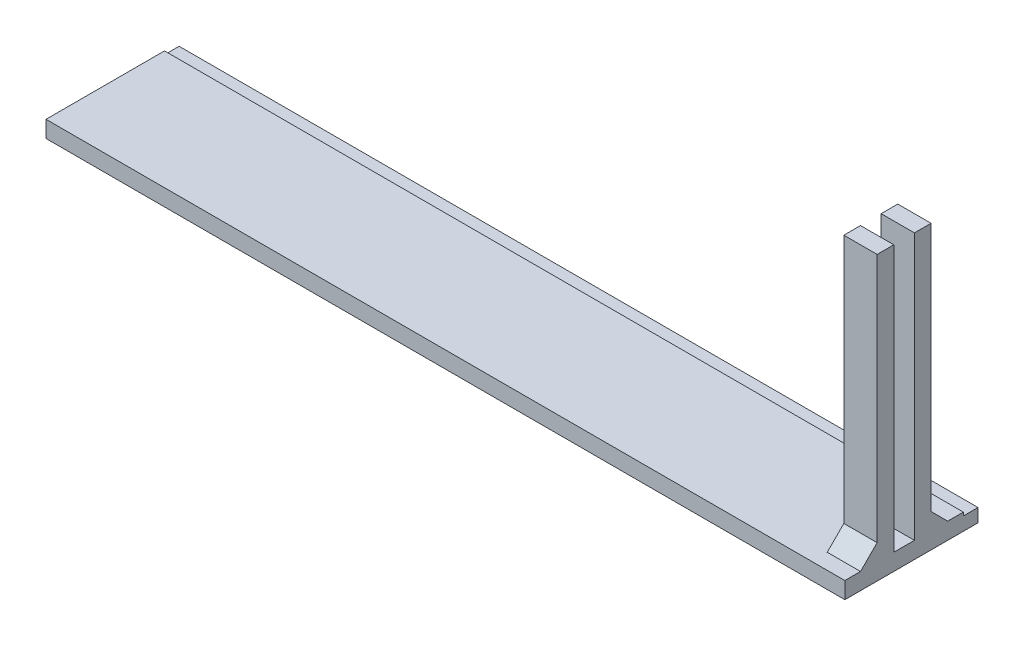
ISO-10303-21;
HEADER;
FILE_DESCRIPTION(('STEP AP214'),'2;1');
FILE_NAME('part.step','',(''),(''),'','','');
FILE_SCHEMA(('AUTOMOTIVE_DESIGN { 1 0 10303 214 1 1 1 1 }'));
ENDSEC;
DATA;
#1=APPLICATION_CONTEXT('core data for automotive mechanical design processes');
#2=APPLICATION_PROTOCOL_DEFINITION('international standard','automotive_design',2000,#1);
#3=PRODUCT_CONTEXT('',#1,'mechanical');
#4=PRODUCT('Part','Part','',(#3));
#5=PRODUCT_RELATED_PRODUCT_CATEGORY('part','',(#4));
#6=PRODUCT_DEFINITION_FORMATION('','',#4);
#7=PRODUCT_DEFINITION_CONTEXT('part definition',#1,'design');
#8=PRODUCT_DEFINITION('design','',#6,#7);
#9=PRODUCT_DEFINITION_SHAPE('','',#8);
#10=(LENGTH_UNIT() NAMED_UNIT(*) SI_UNIT(.MILLI.,.METRE.));
#11=(NAMED_UNIT(*) PLANE_ANGLE_UNIT() SI_UNIT($,.RADIAN.));
#12=(NAMED_UNIT(*) SI_UNIT($,.STERADIAN.) SOLID_ANGLE_UNIT());
#13=UNCERTAINTY_MEASURE_WITH_UNIT(LENGTH_MEASURE(1.E-05),#10,'distance_accuracy_value','');
#14=(GEOMETRIC_REPRESENTATION_CONTEXT(3) GLOBAL_UNCERTAINTY_ASSIGNED_CONTEXT((#13)) GLOBAL_UNIT_ASSIGNED_CONTEXT((#10,
#11,#12)) REPRESENTATION_CONTEXT('',''));
#15=CARTESIAN_POINT('',(0.,0.,0.));
#16=DIRECTION('',(0.,0.,1.));
#17=DIRECTION('',(1.,0.,0.));
#18=AXIS2_PLACEMENT_3D('',#15,#16,#17);
#19=CARTESIAN_POINT('',(0.,3.175,0.));
#20=DIRECTION('',(0.,-1.,0.));
#21=DIRECTION('',(0.,0.,-1.));
#22=AXIS2_PLACEMENT_3D('',#19,#20,#21);
#23=PLANE('',#22);
#24=DIRECTION('',(0.,0.,-1.));
#25=VECTOR('',#24,1.);
#26=CARTESIAN_POINT('',(146.05,3.175,-13.2715));
#27=LINE('',#26,#25);
#28=CARTESIAN_POINT('',(146.05,3.175,-13.2715));
#29=VERTEX_POINT('',#28);
#30=CARTESIAN_POINT('',(146.05,3.175,-19.6215));
#31=VERTEX_POINT('',#30);
#32=EDGE_CURVE('E169',#29,#31,#27,.T.);
#33=ORIENTED_EDGE('',*,*,#32,.T.);
#34=DIRECTION('',(1.,0.,0.));
#35=VECTOR('',#34,1.);
#36=CARTESIAN_POINT('',(0.,3.175,-19.6215));
#37=LINE('',#36,#35);
#38=CARTESIAN_POINT('',(152.4,3.175,-19.6215));
#39=VERTEX_POINT('',#38);
#40=EDGE_CURVE('E310',#31,#39,#37,.T.);
#41=ORIENTED_EDGE('',*,*,#40,.T.);
#42=DIRECTION('',(0.,0.,-1.));
#43=VECTOR('',#42,1.);
#44=CARTESIAN_POINT('',(152.4,3.175,0.));
#45=LINE('',#44,#43);
#46=CARTESIAN_POINT('',(152.4,3.175,-22.606));
#47=VERTEX_POINT('',#46);
#48=EDGE_CURVE('E273',#39,#47,#45,.T.);
#49=ORIENTED_EDGE('',*,*,#48,.T.);
#50=DIRECTION('',(1.,0.,0.));
#51=VECTOR('',#50,1.);
#52=CARTESIAN_POINT('',(0.,3.175,-22.606));
#53=LINE('',#52,#51);
#54=CARTESIAN_POINT('',(0.,3.175,-22.606));
#55=VERTEX_POINT('',#54);
#56=EDGE_CURVE('E234',#55,#47,#53,.T.);
#57=ORIENTED_EDGE('',*,*,#56,.F.);
#58=DIRECTION('',(0.,0.,1.));
#59=VECTOR('',#58,1.);
#60=CARTESIAN_POINT('',(0.,3.175,0.));
#61=LINE('',#60,#59);
#62=CARTESIAN_POINT('',(0.,3.175,0.));
#63=VERTEX_POINT('',#62);
#64=EDGE_CURVE('E266',#55,#63,#61,.T.);
#65=ORIENTED_EDGE('',*,*,#64,.T.);
#66=DIRECTION('',(1.,0.,0.));
#67=VECTOR('',#66,1.);
#68=CARTESIAN_POINT('',(0.,3.175,0.));
#69=LINE('',#68,#67);
#70=CARTESIAN_POINT('',(152.4,3.175,0.));
#71=VERTEX_POINT('',#70);
#72=EDGE_CURVE('E269',#63,#71,#69,.T.);
#73=ORIENTED_EDGE('',*,*,#72,.T.);
#74=CARTESIAN_POINT('',(152.4,3.175,-2.98450000000002));
#75=VERTEX_POINT('',#74);
#76=EDGE_CURVE('E274',#71,#75,#45,.T.);
#77=ORIENTED_EDGE('',*,*,#76,.T.);
#78=DIRECTION('',(-1.,0.,0.));
#79=VECTOR('',#78,1.);
#80=CARTESIAN_POINT('',(0.,3.175,-2.98450000000002));
#81=LINE('',#80,#79);
#82=CARTESIAN_POINT('',(146.05,3.175,-2.98450000000002));
#83=VERTEX_POINT('',#82);
#84=EDGE_CURVE('E306',#75,#83,#81,.T.);
#85=ORIENTED_EDGE('',*,*,#84,.T.);
#86=DIRECTION('',(0.,0.,-1.));
#87=VECTOR('',#86,1.);
#88=CARTESIAN_POINT('',(146.05,3.175,-6.1595));
#89=LINE('',#88,#87);
#90=CARTESIAN_POINT('',(146.05,3.175,-9.3345));
#91=VERTEX_POINT('',#90);
#92=EDGE_CURVE('E207',#83,#91,#89,.T.);
#93=ORIENTED_EDGE('',*,*,#92,.T.);
#94=DIRECTION('',(1.,0.,0.));
#95=VECTOR('',#94,1.);
#96=CARTESIAN_POINT('',(146.05,3.175,-9.3345));
#97=LINE('',#96,#95);
#98=CARTESIAN_POINT('',(152.4,3.175,-9.3345));
#99=VERTEX_POINT('',#98);
#100=EDGE_CURVE('E220',#91,#99,#97,.T.);
#101=ORIENTED_EDGE('',*,*,#100,.T.);
#102=CARTESIAN_POINT('',(152.4,3.175,-13.2715));
#103=VERTEX_POINT('',#102);
#104=EDGE_CURVE('E279',#99,#103,#45,.T.);
#105=ORIENTED_EDGE('',*,*,#104,.T.);
#106=DIRECTION('',(1.,0.,0.));
#107=VECTOR('',#106,1.);
#108=CARTESIAN_POINT('',(146.05,3.175,-13.2715));
#109=LINE('',#108,#107);
#110=EDGE_CURVE('E178',#29,#103,#109,.T.);
#111=ORIENTED_EDGE('',*,*,#110,.F.);
#112=EDGE_LOOP('',(#33,#41,#49,#57,#65,#73,#77,#85,#93,#101,#105,#111));
#113=FACE_BOUND('',#112,.T.);
#114=ADVANCED_FACE('F41',(#113),#23,.F.);
#115=CARTESIAN_POINT('',(0.,3.175,-25.4));
#116=DIRECTION('',(0.,0.,1.));
#117=DIRECTION('',(1.,0.,0.));
#118=AXIS2_PLACEMENT_3D('',#115,#116,#117);
#119=PLANE('',#118);
#120=DIRECTION('',(-1.,0.,0.));
#121=VECTOR('',#120,1.);
#122=CARTESIAN_POINT('',(0.,2.54,-25.4));
#123=LINE('',#122,#121);
#124=CARTESIAN_POINT('',(152.4,2.54,-25.4));
#125=VERTEX_POINT('',#124);
#126=CARTESIAN_POINT('',(0.,2.54,-25.4));
#127=VERTEX_POINT('',#126);
#128=EDGE_CURVE('E252',#125,#127,#123,.T.);
#129=ORIENTED_EDGE('',*,*,#128,.F.);
#130=DIRECTION('',(0.,-1.,0.));
#131=VECTOR('',#130,1.);
#132=CARTESIAN_POINT('',(152.4,3.175,-25.4));
#133=LINE('',#132,#131);
#134=CARTESIAN_POINT('',(152.4,0.,-25.4));
#135=VERTEX_POINT('',#134);
#136=EDGE_CURVE('E295',#125,#135,#133,.T.);
#137=ORIENTED_EDGE('',*,*,#136,.T.);
#138=DIRECTION('',(-1.,0.,0.));
#139=VECTOR('',#138,1.);
#140=CARTESIAN_POINT('',(0.,0.,-25.4));
#141=LINE('',#140,#139);
#142=CARTESIAN_POINT('',(0.,0.,-25.4));
#143=VERTEX_POINT('',#142);
#144=EDGE_CURVE('E270',#135,#143,#141,.T.);
#145=ORIENTED_EDGE('',*,*,#144,.T.);
#146=DIRECTION('',(0.,-1.,0.));
#147=VECTOR('',#146,1.);
#148=CARTESIAN_POINT('',(0.,3.175,-25.4));
#149=LINE('',#148,#147);
#150=EDGE_CURVE('E278',#127,#143,#149,.T.);
#151=ORIENTED_EDGE('',*,*,#150,.F.);
#152=EDGE_LOOP('',(#129,#137,#145,#151));
#153=FACE_BOUND('',#152,.T.);
#154=ADVANCED_FACE('F361',(#153),#119,.F.);
#155=CARTESIAN_POINT('',(0.,3.175,0.));
#156=DIRECTION('',(1.,0.,0.));
#157=DIRECTION('',(0.,0.,-1.));
#158=AXIS2_PLACEMENT_3D('',#155,#156,#157);
#159=PLANE('',#158);
#160=ORIENTED_EDGE('',*,*,#64,.F.);
#161=DIRECTION('',(0.,1.,0.));
#162=VECTOR('',#161,1.);
#163=CARTESIAN_POINT('',(0.,2.54,-22.606));
#164=LINE('',#163,#162);
#165=CARTESIAN_POINT('',(0.,2.54,-22.606));
#166=VERTEX_POINT('',#165);
#167=EDGE_CURVE('E255',#166,#55,#164,.T.);
#168=ORIENTED_EDGE('',*,*,#167,.F.);
#169=DIRECTION('',(0.,0.,1.));
#170=VECTOR('',#169,1.);
#171=CARTESIAN_POINT('',(0.,2.54,-25.4));
#172=LINE('',#171,#170);
#173=EDGE_CURVE('E241',#127,#166,#172,.T.);
#174=ORIENTED_EDGE('',*,*,#173,.F.);
#175=ORIENTED_EDGE('',*,*,#150,.T.);
#176=DIRECTION('',(0.,0.,1.));
#177=VECTOR('',#176,1.);
#178=CARTESIAN_POINT('',(0.,0.,0.));
#179=LINE('',#178,#177);
#180=CARTESIAN_POINT('',(0.,0.,0.));
#181=VERTEX_POINT('',#180);
#182=EDGE_CURVE('E263',#143,#181,#179,.T.);
#183=ORIENTED_EDGE('',*,*,#182,.T.);
#184=DIRECTION('',(0.,-1.,0.));
#185=VECTOR('',#184,1.);
#186=CARTESIAN_POINT('',(0.,3.175,0.));
#187=LINE('',#186,#185);
#188=EDGE_CURVE('E302',#63,#181,#187,.T.);
#189=ORIENTED_EDGE('',*,*,#188,.F.);
#190=EDGE_LOOP('',(#160,#168,#174,#175,#183,#189));
#191=FACE_BOUND('',#190,.T.);
#192=ADVANCED_FACE('F365',(#191),#159,.F.);
#193=CARTESIAN_POINT('',(0.,3.175,0.));
#194=DIRECTION('',(0.,0.,-1.));
#195=DIRECTION('',(-1.,0.,0.));
#196=AXIS2_PLACEMENT_3D('',#193,#194,#195);
#197=PLANE('',#196);
#198=DIRECTION('',(1.,0.,0.));
#199=VECTOR('',#198,1.);
#200=CARTESIAN_POINT('',(0.,0.,0.));
#201=LINE('',#200,#199);
#202=CARTESIAN_POINT('',(152.4,0.,0.));
#203=VERTEX_POINT('',#202);
#204=EDGE_CURVE('E283',#181,#203,#201,.T.);
#205=ORIENTED_EDGE('',*,*,#204,.T.);
#206=DIRECTION('',(0.,-1.,0.));
#207=VECTOR('',#206,1.);
#208=CARTESIAN_POINT('',(152.4,3.175,0.));
#209=LINE('',#208,#207);
#210=EDGE_CURVE('E298',#71,#203,#209,.T.);
#211=ORIENTED_EDGE('',*,*,#210,.F.);
#212=ORIENTED_EDGE('',*,*,#72,.F.);
#213=ORIENTED_EDGE('',*,*,#188,.T.);
#214=EDGE_LOOP('',(#205,#211,#212,#213));
#215=FACE_BOUND('',#214,.T.);
#216=ADVANCED_FACE('F368',(#215),#197,.F.);
#217=CARTESIAN_POINT('',(152.4,3.175,0.));
#218=DIRECTION('',(-1.,0.,0.));
#219=DIRECTION('',(0.,0.,1.));
#220=AXIS2_PLACEMENT_3D('',#217,#218,#219);
#221=PLANE('',#220);
#222=DIRECTION('',(0.,0.,-1.));
#223=VECTOR('',#222,1.);
#224=CARTESIAN_POINT('',(152.4,2.54,-25.4));
#225=LINE('',#224,#223);
#226=CARTESIAN_POINT('',(152.4,2.54,-22.606));
#227=VERTEX_POINT('',#226);
#228=EDGE_CURVE('E249',#227,#125,#225,.T.);
#229=ORIENTED_EDGE('',*,*,#228,.F.);
#230=DIRECTION('',(0.,1.,0.));
#231=VECTOR('',#230,1.);
#232=CARTESIAN_POINT('',(152.4,2.54,-22.606));
#233=LINE('',#232,#231);
#234=EDGE_CURVE('E259',#227,#47,#233,.T.);
#235=ORIENTED_EDGE('',*,*,#234,.T.);
#236=ORIENTED_EDGE('',*,*,#48,.F.);
#237=DIRECTION('',(0.,0.707106781186544,0.707106781186551));
#238=VECTOR('',#237,1.);
#239=CARTESIAN_POINT('',(152.4,12.98575,-9.81074999999993));
#240=LINE('',#239,#238);
#241=CARTESIAN_POINT('',(152.4,6.35,-16.4465));
#242=VERTEX_POINT('',#241);
#243=EDGE_CURVE('E319',#39,#242,#240,.T.);
#244=ORIENTED_EDGE('',*,*,#243,.T.);
#245=DIRECTION('',(0.,1.,0.));
#246=VECTOR('',#245,1.);
#247=CARTESIAN_POINT('',(152.4,3.175,-16.4465));
#248=LINE('',#247,#246);
#249=CARTESIAN_POINT('',(152.4,53.975,-16.4465));
#250=VERTEX_POINT('',#249);
#251=EDGE_CURVE('E196',#242,#250,#248,.T.);
#252=ORIENTED_EDGE('',*,*,#251,.T.);
#253=DIRECTION('',(0.,0.,1.));
#254=VECTOR('',#253,1.);
#255=CARTESIAN_POINT('',(152.4,53.975,-13.2715));
#256=LINE('',#255,#254);
#257=CARTESIAN_POINT('',(152.4,53.975,-13.2715));
#258=VERTEX_POINT('',#257);
#259=EDGE_CURVE('E175',#250,#258,#256,.T.);
#260=ORIENTED_EDGE('',*,*,#259,.T.);
#261=DIRECTION('',(0.,-1.,0.));
#262=VECTOR('',#261,1.);
#263=CARTESIAN_POINT('',(152.4,3.175,-13.2715));
#264=LINE('',#263,#262);
#265=EDGE_CURVE('E192',#258,#103,#264,.T.);
#266=ORIENTED_EDGE('',*,*,#265,.T.);
#267=ORIENTED_EDGE('',*,*,#104,.F.);
#268=DIRECTION('',(0.,1.,0.));
#269=VECTOR('',#268,1.);
#270=CARTESIAN_POINT('',(152.4,3.175,-9.3345));
#271=LINE('',#270,#269);
#272=CARTESIAN_POINT('',(152.4,53.975,-9.3345));
#273=VERTEX_POINT('',#272);
#274=EDGE_CURVE('E224',#99,#273,#271,.T.);
#275=ORIENTED_EDGE('',*,*,#274,.T.);
#276=DIRECTION('',(0.,0.,1.));
#277=VECTOR('',#276,1.);
#278=CARTESIAN_POINT('',(152.4,53.975,-6.1595));
#279=LINE('',#278,#277);
#280=CARTESIAN_POINT('',(152.4,53.975,-6.1595));
#281=VERTEX_POINT('',#280);
#282=EDGE_CURVE('E208',#273,#281,#279,.T.);
#283=ORIENTED_EDGE('',*,*,#282,.T.);
#284=DIRECTION('',(0.,-1.,0.));
#285=VECTOR('',#284,1.);
#286=CARTESIAN_POINT('',(152.4,3.175,-6.1595));
#287=LINE('',#286,#285);
#288=CARTESIAN_POINT('',(152.4,6.35000000000002,-6.1595));
#289=VERTEX_POINT('',#288);
#290=EDGE_CURVE('E202',#281,#289,#287,.T.);
#291=ORIENTED_EDGE('',*,*,#290,.T.);
#292=DIRECTION('',(0.,-0.707106781186552,0.707106781186543));
#293=VECTOR('',#292,1.);
#294=CARTESIAN_POINT('',(152.4,1.68274999999999,-1.49225000000003));
#295=LINE('',#294,#293);
#296=EDGE_CURVE('E51',#289,#75,#295,.T.);
#297=ORIENTED_EDGE('',*,*,#296,.T.);
#298=ORIENTED_EDGE('',*,*,#76,.F.);
#299=ORIENTED_EDGE('',*,*,#210,.T.);
#300=DIRECTION('',(0.,0.,-1.));
#301=VECTOR('',#300,1.);
#302=CARTESIAN_POINT('',(152.4,0.,0.));
#303=LINE('',#302,#301);
#304=EDGE_CURVE('E286',#203,#135,#303,.T.);
#305=ORIENTED_EDGE('',*,*,#304,.T.);
#306=ORIENTED_EDGE('',*,*,#136,.F.);
#307=EDGE_LOOP('',(#229,#235,#236,#244,#252,#260,#266,#267,#275,#283,#291,#297,#298,#299,#305,#306));
#308=FACE_BOUND('',#307,.T.);
#309=ADVANCED_FACE('F328',(#308),#221,.F.);
#310=CARTESIAN_POINT('',(0.,0.,0.));
#311=DIRECTION('',(0.,-1.,0.));
#312=DIRECTION('',(0.,0.,-1.));
#313=AXIS2_PLACEMENT_3D('',#310,#311,#312);
#314=PLANE('',#313);
#315=ORIENTED_EDGE('',*,*,#182,.F.);
#316=ORIENTED_EDGE('',*,*,#144,.F.);
#317=ORIENTED_EDGE('',*,*,#304,.F.);
#318=ORIENTED_EDGE('',*,*,#204,.F.);
#319=EDGE_LOOP('',(#315,#316,#317,#318));
#320=FACE_BOUND('',#319,.T.);
#321=ADVANCED_FACE('F371',(#320),#314,.T.);
#322=CARTESIAN_POINT('',(0.,2.54,-22.606));
#323=DIRECTION('',(0.,0.,1.));
#324=DIRECTION('',(1.,0.,0.));
#325=AXIS2_PLACEMENT_3D('',#322,#323,#324);
#326=PLANE('',#325);
#327=ORIENTED_EDGE('',*,*,#56,.T.);
#328=ORIENTED_EDGE('',*,*,#234,.F.);
#329=DIRECTION('',(1.,0.,0.));
#330=VECTOR('',#329,1.);
#331=CARTESIAN_POINT('',(0.,2.54,-22.606));
#332=LINE('',#331,#330);
#333=EDGE_CURVE('E245',#166,#227,#332,.T.);
#334=ORIENTED_EDGE('',*,*,#333,.F.);
#335=ORIENTED_EDGE('',*,*,#167,.T.);
#336=EDGE_LOOP('',(#327,#328,#334,#335));
#337=FACE_BOUND('',#336,.T.);
#338=ADVANCED_FACE('F352',(#337),#326,.F.);
#339=CARTESIAN_POINT('',(0.,2.54,0.));
#340=DIRECTION('',(0.,1.,0.));
#341=DIRECTION('',(0.,0.,1.));
#342=AXIS2_PLACEMENT_3D('',#339,#340,#341);
#343=PLANE('',#342);
#344=ORIENTED_EDGE('',*,*,#173,.T.);
#345=ORIENTED_EDGE('',*,*,#333,.T.);
#346=ORIENTED_EDGE('',*,*,#228,.T.);
#347=ORIENTED_EDGE('',*,*,#128,.T.);
#348=EDGE_LOOP('',(#344,#345,#346,#347));
#349=FACE_BOUND('',#348,.T.);
#350=ADVANCED_FACE('F357',(#349),#343,.T.);
#351=CARTESIAN_POINT('',(146.05,3.175,-6.1595));
#352=DIRECTION('',(0.,0.,1.));
#353=DIRECTION('',(0.,-1.,0.));
#354=AXIS2_PLACEMENT_3D('',#351,#352,#353);
#355=PLANE('',#354);
#356=DIRECTION('',(0.,-1.,0.));
#357=VECTOR('',#356,1.);
#358=CARTESIAN_POINT('',(146.05,3.175,-6.1595));
#359=LINE('',#358,#357);
#360=CARTESIAN_POINT('',(146.05,53.975,-6.1595));
#361=VERTEX_POINT('',#360);
#362=CARTESIAN_POINT('',(146.05,6.35000000000002,-6.1595));
#363=VERTEX_POINT('',#362);
#364=EDGE_CURVE('E204',#361,#363,#359,.T.);
#365=ORIENTED_EDGE('',*,*,#364,.T.);
#366=DIRECTION('',(1.,0.,0.));
#367=VECTOR('',#366,1.);
#368=CARTESIAN_POINT('',(146.05,6.35000000000002,-6.1595));
#369=LINE('',#368,#367);
#370=EDGE_CURVE('E316',#363,#289,#369,.T.);
#371=ORIENTED_EDGE('',*,*,#370,.T.);
#372=ORIENTED_EDGE('',*,*,#290,.F.);
#373=DIRECTION('',(1.,0.,0.));
#374=VECTOR('',#373,1.);
#375=CARTESIAN_POINT('',(146.05,53.975,-6.1595));
#376=LINE('',#375,#374);
#377=EDGE_CURVE('E231',#361,#281,#376,.T.);
#378=ORIENTED_EDGE('',*,*,#377,.F.);
#379=EDGE_LOOP('',(#365,#371,#372,#378));
#380=FACE_BOUND('',#379,.T.);
#381=ADVANCED_FACE('F334',(#380),#355,.T.);
#382=CARTESIAN_POINT('',(146.05,53.975,-6.1595));
#383=DIRECTION('',(0.,1.,0.));
#384=DIRECTION('',(0.,0.,1.));
#385=AXIS2_PLACEMENT_3D('',#382,#383,#384);
#386=PLANE('',#385);
#387=ORIENTED_EDGE('',*,*,#282,.F.);
#388=DIRECTION('',(1.,0.,0.));
#389=VECTOR('',#388,1.);
#390=CARTESIAN_POINT('',(146.05,53.975,-9.3345));
#391=LINE('',#390,#389);
#392=CARTESIAN_POINT('',(146.05,53.975,-9.3345));
#393=VERTEX_POINT('',#392);
#394=EDGE_CURVE('E235',#393,#273,#391,.T.);
#395=ORIENTED_EDGE('',*,*,#394,.F.);
#396=DIRECTION('',(0.,0.,1.));
#397=VECTOR('',#396,1.);
#398=CARTESIAN_POINT('',(146.05,53.975,-6.1595));
#399=LINE('',#398,#397);
#400=EDGE_CURVE('E216',#393,#361,#399,.T.);
#401=ORIENTED_EDGE('',*,*,#400,.T.);
#402=ORIENTED_EDGE('',*,*,#377,.T.);
#403=EDGE_LOOP('',(#387,#395,#401,#402));
#404=FACE_BOUND('',#403,.T.);
#405=ADVANCED_FACE('F340',(#404),#386,.T.);
#406=CARTESIAN_POINT('',(146.05,3.175,-9.3345));
#407=DIRECTION('',(0.,0.,-1.));
#408=DIRECTION('',(-1.,0.,0.));
#409=AXIS2_PLACEMENT_3D('',#406,#407,#408);
#410=PLANE('',#409);
#411=ORIENTED_EDGE('',*,*,#274,.F.);
#412=ORIENTED_EDGE('',*,*,#100,.F.);
#413=DIRECTION('',(0.,1.,0.));
#414=VECTOR('',#413,1.);
#415=CARTESIAN_POINT('',(146.05,3.175,-9.3345));
#416=LINE('',#415,#414);
#417=EDGE_CURVE('E212',#91,#393,#416,.T.);
#418=ORIENTED_EDGE('',*,*,#417,.T.);
#419=ORIENTED_EDGE('',*,*,#394,.T.);
#420=EDGE_LOOP('',(#411,#412,#418,#419));
#421=FACE_BOUND('',#420,.T.);
#422=ADVANCED_FACE('F342',(#421),#410,.T.);
#423=CARTESIAN_POINT('',(146.05,0.,0.));
#424=DIRECTION('',(-1.,0.,0.));
#425=DIRECTION('',(0.,0.,1.));
#426=AXIS2_PLACEMENT_3D('',#423,#424,#425);
#427=PLANE('',#426);
#428=ORIENTED_EDGE('',*,*,#364,.F.);
#429=ORIENTED_EDGE('',*,*,#400,.F.);
#430=ORIENTED_EDGE('',*,*,#417,.F.);
#431=ORIENTED_EDGE('',*,*,#92,.F.);
#432=DIRECTION('',(0.,0.707106781186552,-0.707106781186543));
#433=VECTOR('',#432,1.);
#434=CARTESIAN_POINT('',(146.05,6.35000000000002,-6.1595));
#435=LINE('',#434,#433);
#436=EDGE_CURVE('E11',#83,#363,#435,.T.);
#437=ORIENTED_EDGE('',*,*,#436,.T.);
#438=EDGE_LOOP('',(#428,#429,#430,#431,#437));
#439=FACE_BOUND('',#438,.T.);
#440=ADVANCED_FACE('F336',(#439),#427,.T.);
#441=CARTESIAN_POINT('',(146.05,3.175,-13.2715));
#442=DIRECTION('',(0.,0.,1.));
#443=DIRECTION('',(1.,0.,0.));
#444=AXIS2_PLACEMENT_3D('',#441,#442,#443);
#445=PLANE('',#444);
#446=ORIENTED_EDGE('',*,*,#265,.F.);
#447=DIRECTION('',(1.,0.,0.));
#448=VECTOR('',#447,1.);
#449=CARTESIAN_POINT('',(146.05,53.975,-13.2715));
#450=LINE('',#449,#448);
#451=CARTESIAN_POINT('',(146.05,53.975,-13.2715));
#452=VERTEX_POINT('',#451);
#453=EDGE_CURVE('E177',#452,#258,#450,.T.);
#454=ORIENTED_EDGE('',*,*,#453,.F.);
#455=DIRECTION('',(0.,-1.,0.));
#456=VECTOR('',#455,1.);
#457=CARTESIAN_POINT('',(146.05,3.175,-13.2715));
#458=LINE('',#457,#456);
#459=EDGE_CURVE('E184',#452,#29,#458,.T.);
#460=ORIENTED_EDGE('',*,*,#459,.T.);
#461=ORIENTED_EDGE('',*,*,#110,.T.);
#462=EDGE_LOOP('',(#446,#454,#460,#461));
#463=FACE_BOUND('',#462,.T.);
#464=ADVANCED_FACE('F400',(#463),#445,.T.);
#465=CARTESIAN_POINT('',(146.05,53.975,-13.2715));
#466=DIRECTION('',(0.,1.,0.));
#467=DIRECTION('',(0.,0.,1.));
#468=AXIS2_PLACEMENT_3D('',#465,#466,#467);
#469=PLANE('',#468);
#470=ORIENTED_EDGE('',*,*,#259,.F.);
#471=DIRECTION('',(1.,0.,0.));
#472=VECTOR('',#471,1.);
#473=CARTESIAN_POINT('',(146.05,53.975,-16.4465));
#474=LINE('',#473,#472);
#475=CARTESIAN_POINT('',(146.05,53.975,-16.4465));
#476=VERTEX_POINT('',#475);
#477=EDGE_CURVE('E159',#476,#250,#474,.T.);
#478=ORIENTED_EDGE('',*,*,#477,.F.);
#479=DIRECTION('',(0.,0.,1.));
#480=VECTOR('',#479,1.);
#481=CARTESIAN_POINT('',(146.05,53.975,-13.2715));
#482=LINE('',#481,#480);
#483=EDGE_CURVE('E168',#476,#452,#482,.T.);
#484=ORIENTED_EDGE('',*,*,#483,.T.);
#485=ORIENTED_EDGE('',*,*,#453,.T.);
#486=EDGE_LOOP('',(#470,#478,#484,#485));
#487=FACE_BOUND('',#486,.T.);
#488=ADVANCED_FACE('F173',(#487),#469,.T.);
#489=CARTESIAN_POINT('',(146.05,3.175,-16.4465));
#490=DIRECTION('',(0.,0.,-1.));
#491=DIRECTION('',(0.,1.,0.));
#492=AXIS2_PLACEMENT_3D('',#489,#490,#491);
#493=PLANE('',#492);
#494=ORIENTED_EDGE('',*,*,#251,.F.);
#495=DIRECTION('',(-1.,0.,0.));
#496=VECTOR('',#495,1.);
#497=CARTESIAN_POINT('',(146.05,6.35,-16.4465));
#498=LINE('',#497,#496);
#499=CARTESIAN_POINT('',(146.05,6.35,-16.4465));
#500=VERTEX_POINT('',#499);
#501=EDGE_CURVE('E162',#242,#500,#498,.T.);
#502=ORIENTED_EDGE('',*,*,#501,.T.);
#503=DIRECTION('',(0.,1.,0.));
#504=VECTOR('',#503,1.);
#505=CARTESIAN_POINT('',(146.05,3.175,-16.4465));
#506=LINE('',#505,#504);
#507=EDGE_CURVE('E155',#500,#476,#506,.T.);
#508=ORIENTED_EDGE('',*,*,#507,.T.);
#509=ORIENTED_EDGE('',*,*,#477,.T.);
#510=EDGE_LOOP('',(#494,#502,#508,#509));
#511=FACE_BOUND('',#510,.T.);
#512=ADVANCED_FACE('F158',(#511),#493,.T.);
#513=CARTESIAN_POINT('',(146.05,0.,0.));
#514=DIRECTION('',(-1.,0.,0.));
#515=DIRECTION('',(0.,0.,1.));
#516=AXIS2_PLACEMENT_3D('',#513,#514,#515);
#517=PLANE('',#516);
#518=ORIENTED_EDGE('',*,*,#459,.F.);
#519=ORIENTED_EDGE('',*,*,#483,.F.);
#520=ORIENTED_EDGE('',*,*,#507,.F.);
#521=DIRECTION('',(0.,-0.707106781186544,-0.707106781186551));
#522=VECTOR('',#521,1.);
#523=CARTESIAN_POINT('',(146.05,3.175,-19.6215));
#524=LINE('',#523,#522);
#525=EDGE_CURVE('E322',#500,#31,#524,.T.);
#526=ORIENTED_EDGE('',*,*,#525,.T.);
#527=ORIENTED_EDGE('',*,*,#32,.F.);
#528=EDGE_LOOP('',(#518,#519,#520,#526,#527));
#529=FACE_BOUND('',#528,.T.);
#530=ADVANCED_FACE('F181',(#529),#517,.T.);
#531=CARTESIAN_POINT('',(0.,3.175,-19.6215));
#532=DIRECTION('',(0.,-0.707106781186551,0.707106781186544));
#533=DIRECTION('',(1.,0.,0.));
#534=AXIS2_PLACEMENT_3D('',#531,#532,#533);
#535=PLANE('',#534);
#536=ORIENTED_EDGE('',*,*,#525,.F.);
#537=ORIENTED_EDGE('',*,*,#501,.F.);
#538=ORIENTED_EDGE('',*,*,#243,.F.);
#539=ORIENTED_EDGE('',*,*,#40,.F.);
#540=EDGE_LOOP('',(#536,#537,#538,#539));
#541=FACE_BOUND('',#540,.T.);
#542=ADVANCED_FACE('F409',(#541),#535,.F.);
#543=CARTESIAN_POINT('',(146.05,6.35000000000002,-6.1595));
#544=DIRECTION('',(0.,-0.707106781186543,-0.707106781186552));
#545=DIRECTION('',(1.,0.,0.));
#546=AXIS2_PLACEMENT_3D('',#543,#544,#545);
#547=PLANE('',#546);
#548=ORIENTED_EDGE('',*,*,#436,.F.);
#549=ORIENTED_EDGE('',*,*,#84,.F.);
#550=ORIENTED_EDGE('',*,*,#296,.F.);
#551=ORIENTED_EDGE('',*,*,#370,.F.);
#552=EDGE_LOOP('',(#548,#549,#550,#551));
#553=FACE_BOUND('',#552,.T.);
#554=ADVANCED_FACE('F44',(#553),#547,.F.);
#555=CLOSED_SHELL('',(#114,#154,#192,#216,#309,#321,#338,#350,#381,#405,#422,#440,#464,#488,
#512,#530,#542,#554));
#556=MANIFOLD_SOLID_BREP('B2',#555);
#557=ADVANCED_BREP_SHAPE_REPRESENTATION('',(#18,#556),#14);
#558=SHAPE_DEFINITION_REPRESENTATION(#9,#557);
ENDSEC;
END-ISO-10303-21;
